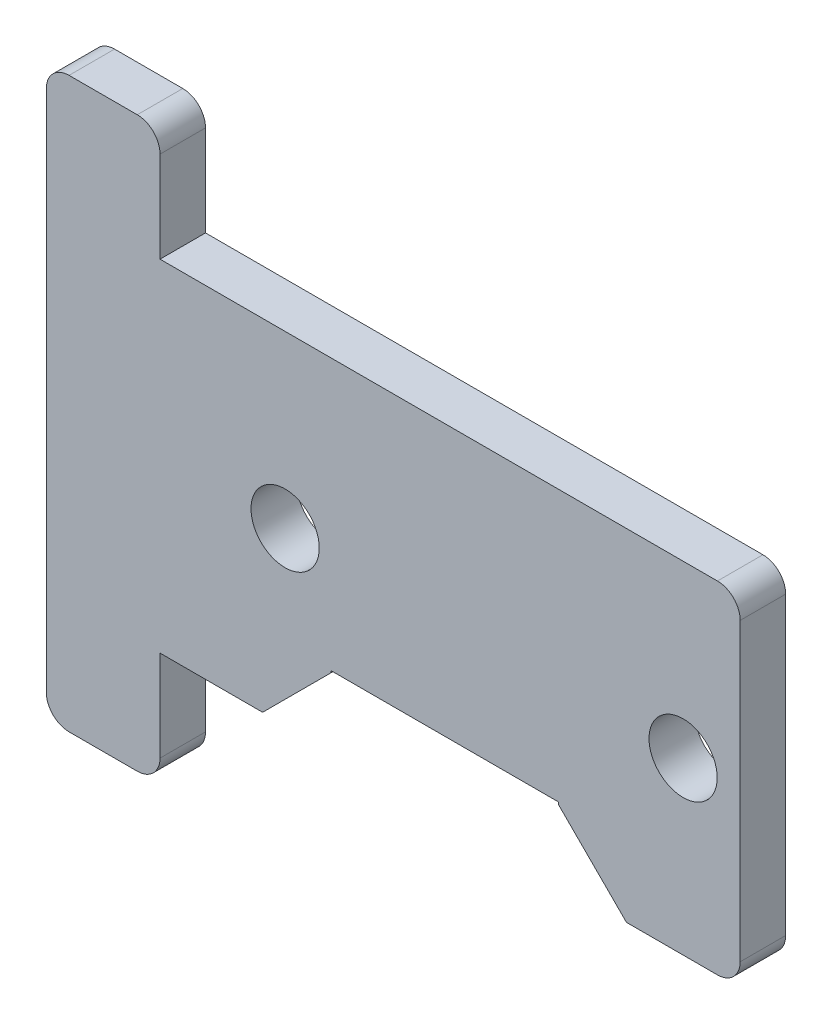
ISO-10303-21;
HEADER;
FILE_DESCRIPTION(('STEP AP214'),'2;1');
FILE_NAME('part.step','',(''),(''),'','','');
FILE_SCHEMA(('AUTOMOTIVE_DESIGN { 1 0 10303 214 1 1 1 1 }'));
ENDSEC;
DATA;
#1=APPLICATION_CONTEXT('core data for automotive mechanical design processes');
#2=APPLICATION_PROTOCOL_DEFINITION('international standard','automotive_design',2000,#1);
#3=PRODUCT_CONTEXT('',#1,'mechanical');
#4=PRODUCT('Part','Part','',(#3));
#5=PRODUCT_RELATED_PRODUCT_CATEGORY('part','',(#4));
#6=PRODUCT_DEFINITION_FORMATION('','',#4);
#7=PRODUCT_DEFINITION_CONTEXT('part definition',#1,'design');
#8=PRODUCT_DEFINITION('design','',#6,#7);
#9=PRODUCT_DEFINITION_SHAPE('','',#8);
#10=(LENGTH_UNIT() NAMED_UNIT(*) SI_UNIT(.MILLI.,.METRE.));
#11=(NAMED_UNIT(*) PLANE_ANGLE_UNIT() SI_UNIT($,.RADIAN.));
#12=(NAMED_UNIT(*) SI_UNIT($,.STERADIAN.) SOLID_ANGLE_UNIT());
#13=UNCERTAINTY_MEASURE_WITH_UNIT(LENGTH_MEASURE(1.E-05),#10,'distance_accuracy_value','');
#14=(GEOMETRIC_REPRESENTATION_CONTEXT(3) GLOBAL_UNCERTAINTY_ASSIGNED_CONTEXT((#13)) GLOBAL_UNIT_ASSIGNED_CONTEXT((#10,
#11,#12)) REPRESENTATION_CONTEXT('',''));
#15=CARTESIAN_POINT('',(0.,0.,0.));
#16=DIRECTION('',(0.,0.,1.));
#17=DIRECTION('',(1.,0.,0.));
#18=AXIS2_PLACEMENT_3D('',#15,#16,#17);
#19=CARTESIAN_POINT('',(-14.6463295776065,11.3032916310451,2.));
#20=DIRECTION('',(0.,0.,-1.));
#21=DIRECTION('',(-1.,0.,0.));
#22=AXIS2_PLACEMENT_3D('',#19,#20,#21);
#23=PLANE('',#22);
#24=CARTESIAN_POINT('',(-14.6463295776065,11.3032916310451,2.));
#25=DIRECTION('',(0.,0.,1.));
#26=DIRECTION('',(-1.,0.,0.));
#27=AXIS2_PLACEMENT_3D('',#24,#25,#26);
#28=CIRCLE('',#27,1.);
#29=CARTESIAN_POINT('',(-14.6463295776064,12.3032916310451,2.));
#30=VERTEX_POINT('',#29);
#31=CARTESIAN_POINT('',(-15.6463295776065,11.3032916310451,2.));
#32=VERTEX_POINT('',#31);
#33=EDGE_CURVE('E240',#30,#32,#28,.T.);
#34=ORIENTED_EDGE('',*,*,#33,.T.);
#35=DIRECTION('',(0.,-1.,0.));
#36=VECTOR('',#35,1.);
#37=CARTESIAN_POINT('',(-15.6463295776065,-11.6967083689549,2.));
#38=LINE('',#37,#36);
#39=CARTESIAN_POINT('',(-15.6463295776065,-11.6967083689549,2.));
#40=VERTEX_POINT('',#39);
#41=EDGE_CURVE('E128',#32,#40,#38,.T.);
#42=ORIENTED_EDGE('',*,*,#41,.T.);
#43=CARTESIAN_POINT('',(-14.6463295776065,-11.6967083689549,2.));
#44=DIRECTION('',(0.,0.,1.));
#45=DIRECTION('',(-1.,0.,0.));
#46=AXIS2_PLACEMENT_3D('',#43,#44,#45);
#47=CIRCLE('',#46,1.);
#48=CARTESIAN_POINT('',(-14.6463295776064,-12.6967083689549,2.));
#49=VERTEX_POINT('',#48);
#50=EDGE_CURVE('E291',#40,#49,#47,.T.);
#51=ORIENTED_EDGE('',*,*,#50,.T.);
#52=DIRECTION('',(1.,0.,0.));
#53=VECTOR('',#52,1.);
#54=CARTESIAN_POINT('',(-11.6463295776065,-12.6967083689549,2.));
#55=LINE('',#54,#53);
#56=CARTESIAN_POINT('',(-11.6463295776065,-12.6967083689549,2.));
#57=VERTEX_POINT('',#56);
#58=EDGE_CURVE('E310',#49,#57,#55,.T.);
#59=ORIENTED_EDGE('',*,*,#58,.T.);
#60=CARTESIAN_POINT('',(-11.6463295776065,-11.6967083689549,2.));
#61=DIRECTION('',(0.,0.,1.));
#62=DIRECTION('',(-1.,0.,0.));
#63=AXIS2_PLACEMENT_3D('',#60,#61,#62);
#64=CIRCLE('',#63,0.999999999999999);
#65=CARTESIAN_POINT('',(-10.6463295776065,-11.6967083689549,2.));
#66=VERTEX_POINT('',#65);
#67=EDGE_CURVE('E307',#57,#66,#64,.T.);
#68=ORIENTED_EDGE('',*,*,#67,.T.);
#69=DIRECTION('',(0.,1.,0.));
#70=VECTOR('',#69,1.);
#71=CARTESIAN_POINT('',(-10.6463295776065,-7.69670836895487,2.));
#72=LINE('',#71,#70);
#73=CARTESIAN_POINT('',(-10.6463295776065,-7.69670836895487,2.));
#74=VERTEX_POINT('',#73);
#75=EDGE_CURVE('E309',#66,#74,#72,.T.);
#76=ORIENTED_EDGE('',*,*,#75,.T.);
#77=DIRECTION('',(1.,0.,0.));
#78=VECTOR('',#77,1.);
#79=CARTESIAN_POINT('',(-6.13632957760645,-7.69670836895487,2.));
#80=LINE('',#79,#78);
#81=CARTESIAN_POINT('',(-6.13632957760645,-7.69670836895487,2.));
#82=VERTEX_POINT('',#81);
#83=EDGE_CURVE('E312',#74,#82,#80,.T.);
#84=ORIENTED_EDGE('',*,*,#83,.T.);
#85=DIRECTION('',(0.707106781186548,0.707106781186548,0.));
#86=VECTOR('',#85,1.);
#87=CARTESIAN_POINT('',(-3.13632957760645,-4.69670836895487,2.));
#88=LINE('',#87,#86);
#89=CARTESIAN_POINT('',(-3.13632957760645,-4.69670836895487,2.));
#90=VERTEX_POINT('',#89);
#91=EDGE_CURVE('E318',#82,#90,#88,.T.);
#92=ORIENTED_EDGE('',*,*,#91,.T.);
#93=DIRECTION('',(0.,1.,0.));
#94=VECTOR('',#93,1.);
#95=CARTESIAN_POINT('',(-3.13632957760645,-4.60540346731287,2.));
#96=LINE('',#95,#94);
#97=CARTESIAN_POINT('',(-3.13632957760645,-4.60540346731287,2.));
#98=VERTEX_POINT('',#97);
#99=EDGE_CURVE('E320',#90,#98,#96,.T.);
#100=ORIENTED_EDGE('',*,*,#99,.T.);
#101=DIRECTION('',(1.,0.,0.));
#102=VECTOR('',#101,1.);
#103=CARTESIAN_POINT('',(6.86367042239355,-4.60540346731287,2.));
#104=LINE('',#103,#102);
#105=CARTESIAN_POINT('',(6.86367042239355,-4.60540346731287,2.));
#106=VERTEX_POINT('',#105);
#107=EDGE_CURVE('E322',#98,#106,#104,.T.);
#108=ORIENTED_EDGE('',*,*,#107,.T.);
#109=DIRECTION('',(0.,-1.,0.));
#110=VECTOR('',#109,1.);
#111=CARTESIAN_POINT('',(6.86367042239355,-4.60540346731287,2.));
#112=LINE('',#111,#110);
#113=CARTESIAN_POINT('',(6.86367042239355,-4.69670836895487,2.));
#114=VERTEX_POINT('',#113);
#115=EDGE_CURVE('E324',#106,#114,#112,.T.);
#116=ORIENTED_EDGE('',*,*,#115,.T.);
#117=DIRECTION('',(0.707106781186548,-0.707106781186548,0.));
#118=VECTOR('',#117,1.);
#119=CARTESIAN_POINT('',(6.86367042239355,-4.69670836895487,2.));
#120=LINE('',#119,#118);
#121=CARTESIAN_POINT('',(9.86367042239355,-7.69670836895487,2.));
#122=VERTEX_POINT('',#121);
#123=EDGE_CURVE('E326',#114,#122,#120,.T.);
#124=ORIENTED_EDGE('',*,*,#123,.T.);
#125=DIRECTION('',(1.,0.,0.));
#126=VECTOR('',#125,1.);
#127=CARTESIAN_POINT('',(13.8636704223935,-7.69670836895487,2.));
#128=LINE('',#127,#126);
#129=CARTESIAN_POINT('',(13.8636704223935,-7.69670836895487,2.));
#130=VERTEX_POINT('',#129);
#131=EDGE_CURVE('E328',#122,#130,#128,.T.);
#132=ORIENTED_EDGE('',*,*,#131,.T.);
#133=CARTESIAN_POINT('',(13.8636704223935,-6.69670836895487,2.));
#134=DIRECTION('',(0.,0.,1.));
#135=DIRECTION('',(1.,0.,0.));
#136=AXIS2_PLACEMENT_3D('',#133,#134,#135);
#137=CIRCLE('',#136,1.);
#138=CARTESIAN_POINT('',(14.8636704223936,-6.69670836895487,2.));
#139=VERTEX_POINT('',#138);
#140=EDGE_CURVE('E330',#130,#139,#137,.T.);
#141=ORIENTED_EDGE('',*,*,#140,.T.);
#142=DIRECTION('',(0.,1.,0.));
#143=VECTOR('',#142,1.);
#144=CARTESIAN_POINT('',(14.8636704223936,-6.69670836895487,2.));
#145=LINE('',#144,#143);
#146=CARTESIAN_POINT('',(14.8636704223936,6.30329163104513,2.));
#147=VERTEX_POINT('',#146);
#148=EDGE_CURVE('E332',#139,#147,#145,.T.);
#149=ORIENTED_EDGE('',*,*,#148,.T.);
#150=CARTESIAN_POINT('',(13.8636704223935,6.30329163104513,2.));
#151=DIRECTION('',(0.,0.,1.));
#152=DIRECTION('',(1.,0.,0.));
#153=AXIS2_PLACEMENT_3D('',#150,#151,#152);
#154=CIRCLE('',#153,1.);
#155=CARTESIAN_POINT('',(13.8636704223935,7.30329163104513,2.));
#156=VERTEX_POINT('',#155);
#157=EDGE_CURVE('E334',#147,#156,#154,.T.);
#158=ORIENTED_EDGE('',*,*,#157,.T.);
#159=DIRECTION('',(-1.,0.,0.));
#160=VECTOR('',#159,1.);
#161=CARTESIAN_POINT('',(13.8636704223935,7.30329163104513,2.));
#162=LINE('',#161,#160);
#163=CARTESIAN_POINT('',(-10.6463295776065,7.30329163104513,2.));
#164=VERTEX_POINT('',#163);
#165=EDGE_CURVE('E183',#156,#164,#162,.T.);
#166=ORIENTED_EDGE('',*,*,#165,.T.);
#167=DIRECTION('',(0.,1.,0.));
#168=VECTOR('',#167,1.);
#169=CARTESIAN_POINT('',(-10.6463295776064,11.3032916310451,2.));
#170=LINE('',#169,#168);
#171=CARTESIAN_POINT('',(-10.6463295776064,11.3032916310451,2.));
#172=VERTEX_POINT('',#171);
#173=EDGE_CURVE('E177',#164,#172,#170,.T.);
#174=ORIENTED_EDGE('',*,*,#173,.T.);
#175=CARTESIAN_POINT('',(-11.6463295776065,11.3032916310451,2.));
#176=DIRECTION('',(0.,0.,1.));
#177=DIRECTION('',(-1.,0.,0.));
#178=AXIS2_PLACEMENT_3D('',#175,#176,#177);
#179=CIRCLE('',#178,1.);
#180=CARTESIAN_POINT('',(-11.6463295776065,12.3032916310451,2.));
#181=VERTEX_POINT('',#180);
#182=EDGE_CURVE('E181',#172,#181,#179,.T.);
#183=ORIENTED_EDGE('',*,*,#182,.T.);
#184=DIRECTION('',(-1.,0.,0.));
#185=VECTOR('',#184,1.);
#186=CARTESIAN_POINT('',(-14.6463295776064,12.3032916310451,2.));
#187=LINE('',#186,#185);
#188=EDGE_CURVE('E49',#181,#30,#187,.T.);
#189=ORIENTED_EDGE('',*,*,#188,.T.);
#190=EDGE_LOOP('',(#34,#42,#51,#59,#68,#76,#84,#92,#100,#108,#116,#124,#132,#141,#149,#158,#166,
#174,#183,#189));
#191=FACE_BOUND('',#190,.T.);
#192=CARTESIAN_POINT('',(12.3536704223936,-0.196708368954862,2.));
#193=DIRECTION('',(0.,0.,1.));
#194=DIRECTION('',(1.,0.,0.));
#195=AXIS2_PLACEMENT_3D('',#192,#193,#194);
#196=CIRCLE('',#195,1.5);
#197=CARTESIAN_POINT('',(13.8536704223935,-0.196708368954862,2.));
#198=VERTEX_POINT('',#197);
#199=EDGE_CURVE('E205',#198,#198,#196,.T.);
#200=ORIENTED_EDGE('',*,*,#199,.F.);
#201=EDGE_LOOP('',(#200));
#202=FACE_BOUND('',#201,.T.);
#203=CARTESIAN_POINT('',(-5.14632957760645,-0.196708368954869,2.));
#204=DIRECTION('',(0.,0.,1.));
#205=DIRECTION('',(1.,0.,0.));
#206=AXIS2_PLACEMENT_3D('',#203,#204,#205);
#207=CIRCLE('',#206,1.5);
#208=CARTESIAN_POINT('',(-3.64632957760645,-0.196708368954869,2.));
#209=VERTEX_POINT('',#208);
#210=EDGE_CURVE('E375',#209,#209,#207,.T.);
#211=ORIENTED_EDGE('',*,*,#210,.F.);
#212=EDGE_LOOP('',(#211));
#213=FACE_BOUND('',#212,.T.);
#214=ADVANCED_FACE('F32',(#191,#202,#213),#23,.F.);
#215=CARTESIAN_POINT('',(-14.6463295776065,11.3032916310451,0.));
#216=DIRECTION('',(0.,0.,-1.));
#217=DIRECTION('',(-1.,0.,0.));
#218=AXIS2_PLACEMENT_3D('',#215,#216,#217);
#219=PLANE('',#218);
#220=CARTESIAN_POINT('',(12.3536704223936,-0.196708368954862,0.));
#221=DIRECTION('',(0.,0.,1.));
#222=DIRECTION('',(1.,0.,0.));
#223=AXIS2_PLACEMENT_3D('',#220,#221,#222);
#224=CIRCLE('',#223,1.5);
#225=CARTESIAN_POINT('',(13.8536704223935,-0.196708368954862,0.));
#226=VERTEX_POINT('',#225);
#227=EDGE_CURVE('E380',#226,#226,#224,.T.);
#228=ORIENTED_EDGE('',*,*,#227,.T.);
#229=EDGE_LOOP('',(#228));
#230=FACE_BOUND('',#229,.T.);
#231=CARTESIAN_POINT('',(-14.6463295776065,11.3032916310451,0.));
#232=DIRECTION('',(0.,0.,1.));
#233=DIRECTION('',(-1.,0.,0.));
#234=AXIS2_PLACEMENT_3D('',#231,#232,#233);
#235=CIRCLE('',#234,1.);
#236=CARTESIAN_POINT('',(-14.6463295776064,12.3032916310451,0.));
#237=VERTEX_POINT('',#236);
#238=CARTESIAN_POINT('',(-15.6463295776065,11.3032916310451,0.));
#239=VERTEX_POINT('',#238);
#240=EDGE_CURVE('E201',#237,#239,#235,.T.);
#241=ORIENTED_EDGE('',*,*,#240,.F.);
#242=DIRECTION('',(-1.,0.,0.));
#243=VECTOR('',#242,1.);
#244=CARTESIAN_POINT('',(-14.6463295776064,12.3032916310451,0.));
#245=LINE('',#244,#243);
#246=CARTESIAN_POINT('',(-11.6463295776065,12.3032916310451,0.));
#247=VERTEX_POINT('',#246);
#248=EDGE_CURVE('E120',#247,#237,#245,.T.);
#249=ORIENTED_EDGE('',*,*,#248,.F.);
#250=CARTESIAN_POINT('',(-11.6463295776065,11.3032916310451,0.));
#251=DIRECTION('',(0.,0.,1.));
#252=DIRECTION('',(-1.,0.,0.));
#253=AXIS2_PLACEMENT_3D('',#250,#251,#252);
#254=CIRCLE('',#253,1.);
#255=CARTESIAN_POINT('',(-10.6463295776064,11.3032916310451,0.));
#256=VERTEX_POINT('',#255);
#257=EDGE_CURVE('E114',#256,#247,#254,.T.);
#258=ORIENTED_EDGE('',*,*,#257,.F.);
#259=DIRECTION('',(0.,1.,0.));
#260=VECTOR('',#259,1.);
#261=CARTESIAN_POINT('',(-10.6463295776064,11.3032916310451,0.));
#262=LINE('',#261,#260);
#263=CARTESIAN_POINT('',(-10.6463295776065,7.30329163104513,0.));
#264=VERTEX_POINT('',#263);
#265=EDGE_CURVE('E191',#264,#256,#262,.T.);
#266=ORIENTED_EDGE('',*,*,#265,.F.);
#267=DIRECTION('',(-1.,0.,0.));
#268=VECTOR('',#267,1.);
#269=CARTESIAN_POINT('',(13.8636704223935,7.30329163104513,0.));
#270=LINE('',#269,#268);
#271=CARTESIAN_POINT('',(13.8636704223935,7.30329163104513,0.));
#272=VERTEX_POINT('',#271);
#273=EDGE_CURVE('E235',#272,#264,#270,.T.);
#274=ORIENTED_EDGE('',*,*,#273,.F.);
#275=CARTESIAN_POINT('',(13.8636704223935,6.30329163104513,0.));
#276=DIRECTION('',(0.,0.,1.));
#277=DIRECTION('',(1.,0.,0.));
#278=AXIS2_PLACEMENT_3D('',#275,#276,#277);
#279=CIRCLE('',#278,1.);
#280=CARTESIAN_POINT('',(14.8636704223936,6.30329163104513,0.));
#281=VERTEX_POINT('',#280);
#282=EDGE_CURVE('E233',#281,#272,#279,.T.);
#283=ORIENTED_EDGE('',*,*,#282,.F.);
#284=DIRECTION('',(0.,1.,0.));
#285=VECTOR('',#284,1.);
#286=CARTESIAN_POINT('',(14.8636704223936,-6.69670836895487,0.));
#287=LINE('',#286,#285);
#288=CARTESIAN_POINT('',(14.8636704223936,-6.69670836895487,0.));
#289=VERTEX_POINT('',#288);
#290=EDGE_CURVE('E231',#289,#281,#287,.T.);
#291=ORIENTED_EDGE('',*,*,#290,.F.);
#292=CARTESIAN_POINT('',(13.8636704223935,-6.69670836895487,0.));
#293=DIRECTION('',(0.,0.,1.));
#294=DIRECTION('',(1.,0.,0.));
#295=AXIS2_PLACEMENT_3D('',#292,#293,#294);
#296=CIRCLE('',#295,1.);
#297=CARTESIAN_POINT('',(13.8636704223935,-7.69670836895487,0.));
#298=VERTEX_POINT('',#297);
#299=EDGE_CURVE('E229',#298,#289,#296,.T.);
#300=ORIENTED_EDGE('',*,*,#299,.F.);
#301=DIRECTION('',(1.,0.,0.));
#302=VECTOR('',#301,1.);
#303=CARTESIAN_POINT('',(13.8636704223935,-7.69670836895487,0.));
#304=LINE('',#303,#302);
#305=CARTESIAN_POINT('',(9.86367042239355,-7.69670836895487,0.));
#306=VERTEX_POINT('',#305);
#307=EDGE_CURVE('E227',#306,#298,#304,.T.);
#308=ORIENTED_EDGE('',*,*,#307,.F.);
#309=DIRECTION('',(0.707106781186548,-0.707106781186548,0.));
#310=VECTOR('',#309,1.);
#311=CARTESIAN_POINT('',(6.86367042239355,-4.69670836895487,0.));
#312=LINE('',#311,#310);
#313=CARTESIAN_POINT('',(6.86367042239355,-4.69670836895487,0.));
#314=VERTEX_POINT('',#313);
#315=EDGE_CURVE('E225',#314,#306,#312,.T.);
#316=ORIENTED_EDGE('',*,*,#315,.F.);
#317=DIRECTION('',(0.,-1.,0.));
#318=VECTOR('',#317,1.);
#319=CARTESIAN_POINT('',(6.86367042239355,-4.60540346731287,0.));
#320=LINE('',#319,#318);
#321=CARTESIAN_POINT('',(6.86367042239355,-4.60540346731287,0.));
#322=VERTEX_POINT('',#321);
#323=EDGE_CURVE('E223',#322,#314,#320,.T.);
#324=ORIENTED_EDGE('',*,*,#323,.F.);
#325=DIRECTION('',(1.,0.,0.));
#326=VECTOR('',#325,1.);
#327=CARTESIAN_POINT('',(6.86367042239355,-4.60540346731287,0.));
#328=LINE('',#327,#326);
#329=CARTESIAN_POINT('',(-3.13632957760645,-4.60540346731287,0.));
#330=VERTEX_POINT('',#329);
#331=EDGE_CURVE('E221',#330,#322,#328,.T.);
#332=ORIENTED_EDGE('',*,*,#331,.F.);
#333=DIRECTION('',(0.,1.,0.));
#334=VECTOR('',#333,1.);
#335=CARTESIAN_POINT('',(-3.13632957760645,-4.60540346731287,0.));
#336=LINE('',#335,#334);
#337=CARTESIAN_POINT('',(-3.13632957760645,-4.69670836895487,0.));
#338=VERTEX_POINT('',#337);
#339=EDGE_CURVE('E219',#338,#330,#336,.T.);
#340=ORIENTED_EDGE('',*,*,#339,.F.);
#341=DIRECTION('',(0.707106781186548,0.707106781186548,0.));
#342=VECTOR('',#341,1.);
#343=CARTESIAN_POINT('',(-3.13632957760645,-4.69670836895487,0.));
#344=LINE('',#343,#342);
#345=CARTESIAN_POINT('',(-6.13632957760645,-7.69670836895487,0.));
#346=VERTEX_POINT('',#345);
#347=EDGE_CURVE('E217',#346,#338,#344,.T.);
#348=ORIENTED_EDGE('',*,*,#347,.F.);
#349=DIRECTION('',(1.,0.,0.));
#350=VECTOR('',#349,1.);
#351=CARTESIAN_POINT('',(-6.13632957760645,-7.69670836895487,0.));
#352=LINE('',#351,#350);
#353=CARTESIAN_POINT('',(-10.6463295776065,-7.69670836895487,0.));
#354=VERTEX_POINT('',#353);
#355=EDGE_CURVE('E215',#354,#346,#352,.T.);
#356=ORIENTED_EDGE('',*,*,#355,.F.);
#357=DIRECTION('',(0.,1.,0.));
#358=VECTOR('',#357,1.);
#359=CARTESIAN_POINT('',(-10.6463295776065,-7.69670836895487,0.));
#360=LINE('',#359,#358);
#361=CARTESIAN_POINT('',(-10.6463295776065,-11.6967083689549,0.));
#362=VERTEX_POINT('',#361);
#363=EDGE_CURVE('E213',#362,#354,#360,.T.);
#364=ORIENTED_EDGE('',*,*,#363,.F.);
#365=CARTESIAN_POINT('',(-11.6463295776065,-11.6967083689549,0.));
#366=DIRECTION('',(0.,0.,1.));
#367=DIRECTION('',(-1.,0.,0.));
#368=AXIS2_PLACEMENT_3D('',#365,#366,#367);
#369=CIRCLE('',#368,0.999999999999999);
#370=CARTESIAN_POINT('',(-11.6463295776065,-12.6967083689549,0.));
#371=VERTEX_POINT('',#370);
#372=EDGE_CURVE('E211',#371,#362,#369,.T.);
#373=ORIENTED_EDGE('',*,*,#372,.F.);
#374=DIRECTION('',(1.,0.,0.));
#375=VECTOR('',#374,1.);
#376=CARTESIAN_POINT('',(-11.6463295776065,-12.6967083689549,0.));
#377=LINE('',#376,#375);
#378=CARTESIAN_POINT('',(-14.6463295776064,-12.6967083689549,0.));
#379=VERTEX_POINT('',#378);
#380=EDGE_CURVE('E209',#379,#371,#377,.T.);
#381=ORIENTED_EDGE('',*,*,#380,.F.);
#382=CARTESIAN_POINT('',(-14.6463295776065,-11.6967083689549,0.));
#383=DIRECTION('',(0.,0.,1.));
#384=DIRECTION('',(-1.,0.,0.));
#385=AXIS2_PLACEMENT_3D('',#382,#383,#384);
#386=CIRCLE('',#385,1.);
#387=CARTESIAN_POINT('',(-15.6463295776065,-11.6967083689549,0.));
#388=VERTEX_POINT('',#387);
#389=EDGE_CURVE('E207',#388,#379,#386,.T.);
#390=ORIENTED_EDGE('',*,*,#389,.F.);
#391=DIRECTION('',(0.,-1.,0.));
#392=VECTOR('',#391,1.);
#393=CARTESIAN_POINT('',(-15.6463295776065,-11.6967083689549,0.));
#394=LINE('',#393,#392);
#395=EDGE_CURVE('E204',#239,#388,#394,.T.);
#396=ORIENTED_EDGE('',*,*,#395,.F.);
#397=EDGE_LOOP('',(#241,#249,#258,#266,#274,#283,#291,#300,#308,#316,#324,#332,#340,#348,#356,
#364,#373,#381,#390,#396));
#398=FACE_BOUND('',#397,.T.);
#399=CARTESIAN_POINT('',(-5.14632957760645,-0.196708368954869,0.));
#400=DIRECTION('',(0.,0.,1.));
#401=DIRECTION('',(1.,0.,0.));
#402=AXIS2_PLACEMENT_3D('',#399,#400,#401);
#403=CIRCLE('',#402,1.5);
#404=CARTESIAN_POINT('',(-3.64632957760645,-0.196708368954869,0.));
#405=VERTEX_POINT('',#404);
#406=EDGE_CURVE('E378',#405,#405,#403,.T.);
#407=ORIENTED_EDGE('',*,*,#406,.T.);
#408=EDGE_LOOP('',(#407));
#409=FACE_BOUND('',#408,.T.);
#410=ADVANCED_FACE('F295',(#230,#398,#409),#219,.T.);
#411=CARTESIAN_POINT('',(-14.6463295776065,11.3032916310451,2.));
#412=DIRECTION('',(0.,0.,-1.));
#413=DIRECTION('',(-1.,0.,0.));
#414=AXIS2_PLACEMENT_3D('',#411,#412,#413);
#415=CYLINDRICAL_SURFACE('',#414,1.);
#416=ORIENTED_EDGE('',*,*,#240,.T.);
#417=DIRECTION('',(0.,0.,-1.));
#418=VECTOR('',#417,1.);
#419=CARTESIAN_POINT('',(-15.6463295776065,11.3032916310451,2.));
#420=LINE('',#419,#418);
#421=EDGE_CURVE('E11',#32,#239,#420,.T.);
#422=ORIENTED_EDGE('',*,*,#421,.F.);
#423=ORIENTED_EDGE('',*,*,#33,.F.);
#424=DIRECTION('',(0.,0.,-1.));
#425=VECTOR('',#424,1.);
#426=CARTESIAN_POINT('',(-14.6463295776064,12.3032916310451,2.));
#427=LINE('',#426,#425);
#428=EDGE_CURVE('E197',#30,#237,#427,.T.);
#429=ORIENTED_EDGE('',*,*,#428,.T.);
#430=EDGE_LOOP('',(#416,#422,#423,#429));
#431=FACE_BOUND('',#430,.T.);
#432=ADVANCED_FACE('F34',(#431),#415,.T.);
#433=CARTESIAN_POINT('',(-15.6463295776065,-11.6967083689549,2.));
#434=DIRECTION('',(1.,0.,0.));
#435=DIRECTION('',(0.,0.,-1.));
#436=AXIS2_PLACEMENT_3D('',#433,#434,#435);
#437=PLANE('',#436);
#438=ORIENTED_EDGE('',*,*,#395,.T.);
#439=DIRECTION('',(0.,0.,-1.));
#440=VECTOR('',#439,1.);
#441=CARTESIAN_POINT('',(-15.6463295776065,-11.6967083689549,2.));
#442=LINE('',#441,#440);
#443=EDGE_CURVE('E41',#40,#388,#442,.T.);
#444=ORIENTED_EDGE('',*,*,#443,.F.);
#445=ORIENTED_EDGE('',*,*,#41,.F.);
#446=ORIENTED_EDGE('',*,*,#421,.T.);
#447=EDGE_LOOP('',(#438,#444,#445,#446));
#448=FACE_BOUND('',#447,.T.);
#449=ADVANCED_FACE('F555',(#448),#437,.F.);
#450=CARTESIAN_POINT('',(-14.6463295776065,-11.6967083689549,2.));
#451=DIRECTION('',(0.,0.,-1.));
#452=DIRECTION('',(-1.,0.,0.));
#453=AXIS2_PLACEMENT_3D('',#450,#451,#452);
#454=CYLINDRICAL_SURFACE('',#453,1.);
#455=ORIENTED_EDGE('',*,*,#389,.T.);
#456=DIRECTION('',(0.,0.,-1.));
#457=VECTOR('',#456,1.);
#458=CARTESIAN_POINT('',(-14.6463295776064,-12.6967083689549,2.));
#459=LINE('',#458,#457);
#460=EDGE_CURVE('E283',#49,#379,#459,.T.);
#461=ORIENTED_EDGE('',*,*,#460,.F.);
#462=ORIENTED_EDGE('',*,*,#50,.F.);
#463=ORIENTED_EDGE('',*,*,#443,.T.);
#464=EDGE_LOOP('',(#455,#461,#462,#463));
#465=FACE_BOUND('',#464,.T.);
#466=ADVANCED_FACE('F289',(#465),#454,.T.);
#467=CARTESIAN_POINT('',(-11.6463295776065,-12.6967083689549,2.));
#468=DIRECTION('',(0.,1.,0.));
#469=DIRECTION('',(-1.,0.,0.));
#470=AXIS2_PLACEMENT_3D('',#467,#468,#469);
#471=PLANE('',#470);
#472=ORIENTED_EDGE('',*,*,#380,.T.);
#473=DIRECTION('',(0.,0.,-1.));
#474=VECTOR('',#473,1.);
#475=CARTESIAN_POINT('',(-11.6463295776065,-12.6967083689549,2.));
#476=LINE('',#475,#474);
#477=EDGE_CURVE('E280',#57,#371,#476,.T.);
#478=ORIENTED_EDGE('',*,*,#477,.F.);
#479=ORIENTED_EDGE('',*,*,#58,.F.);
#480=ORIENTED_EDGE('',*,*,#460,.T.);
#481=EDGE_LOOP('',(#472,#478,#479,#480));
#482=FACE_BOUND('',#481,.T.);
#483=ADVANCED_FACE('F301',(#482),#471,.F.);
#484=CARTESIAN_POINT('',(-11.6463295776065,-11.6967083689549,2.));
#485=DIRECTION('',(0.,0.,-1.));
#486=DIRECTION('',(-1.,0.,0.));
#487=AXIS2_PLACEMENT_3D('',#484,#485,#486);
#488=CYLINDRICAL_SURFACE('',#487,0.999999999999999);
#489=ORIENTED_EDGE('',*,*,#372,.T.);
#490=DIRECTION('',(0.,0.,-1.));
#491=VECTOR('',#490,1.);
#492=CARTESIAN_POINT('',(-10.6463295776065,-11.6967083689549,2.));
#493=LINE('',#492,#491);
#494=EDGE_CURVE('E277',#66,#362,#493,.T.);
#495=ORIENTED_EDGE('',*,*,#494,.F.);
#496=ORIENTED_EDGE('',*,*,#67,.F.);
#497=ORIENTED_EDGE('',*,*,#477,.T.);
#498=EDGE_LOOP('',(#489,#495,#496,#497));
#499=FACE_BOUND('',#498,.T.);
#500=ADVANCED_FACE('F305',(#499),#488,.T.);
#501=CARTESIAN_POINT('',(-10.6463295776065,-7.69670836895487,2.));
#502=DIRECTION('',(-1.,0.,0.));
#503=DIRECTION('',(0.,-1.,0.));
#504=AXIS2_PLACEMENT_3D('',#501,#502,#503);
#505=PLANE('',#504);
#506=ORIENTED_EDGE('',*,*,#363,.T.);
#507=DIRECTION('',(0.,0.,-1.));
#508=VECTOR('',#507,1.);
#509=CARTESIAN_POINT('',(-10.6463295776065,-7.69670836895487,2.));
#510=LINE('',#509,#508);
#511=EDGE_CURVE('E274',#74,#354,#510,.T.);
#512=ORIENTED_EDGE('',*,*,#511,.F.);
#513=ORIENTED_EDGE('',*,*,#75,.F.);
#514=ORIENTED_EDGE('',*,*,#494,.T.);
#515=EDGE_LOOP('',(#506,#512,#513,#514));
#516=FACE_BOUND('',#515,.T.);
#517=ADVANCED_FACE('F520',(#516),#505,.F.);
#518=CARTESIAN_POINT('',(-6.13632957760645,-7.69670836895487,2.));
#519=DIRECTION('',(0.,1.,0.));
#520=DIRECTION('',(-1.,0.,0.));
#521=AXIS2_PLACEMENT_3D('',#518,#519,#520);
#522=PLANE('',#521);
#523=ORIENTED_EDGE('',*,*,#355,.T.);
#524=DIRECTION('',(0.,0.,-1.));
#525=VECTOR('',#524,1.);
#526=CARTESIAN_POINT('',(-6.13632957760645,-7.69670836895487,2.));
#527=LINE('',#526,#525);
#528=EDGE_CURVE('E271',#82,#346,#527,.T.);
#529=ORIENTED_EDGE('',*,*,#528,.F.);
#530=ORIENTED_EDGE('',*,*,#83,.F.);
#531=ORIENTED_EDGE('',*,*,#511,.T.);
#532=EDGE_LOOP('',(#523,#529,#530,#531));
#533=FACE_BOUND('',#532,.T.);
#534=ADVANCED_FACE('F510',(#533),#522,.F.);
#535=CARTESIAN_POINT('',(-3.13632957760645,-4.69670836895487,2.));
#536=DIRECTION('',(-0.707106781186547,0.707106781186547,0.));
#537=DIRECTION('',(-0.707106781186548,-0.707106781186548,0.));
#538=AXIS2_PLACEMENT_3D('',#535,#536,#537);
#539=PLANE('',#538);
#540=ORIENTED_EDGE('',*,*,#347,.T.);
#541=DIRECTION('',(0.,0.,-1.));
#542=VECTOR('',#541,1.);
#543=CARTESIAN_POINT('',(-3.13632957760645,-4.69670836895487,2.));
#544=LINE('',#543,#542);
#545=EDGE_CURVE('E268',#90,#338,#544,.T.);
#546=ORIENTED_EDGE('',*,*,#545,.F.);
#547=ORIENTED_EDGE('',*,*,#91,.F.);
#548=ORIENTED_EDGE('',*,*,#528,.T.);
#549=EDGE_LOOP('',(#540,#546,#547,#548));
#550=FACE_BOUND('',#549,.T.);
#551=ADVANCED_FACE('F500',(#550),#539,.F.);
#552=CARTESIAN_POINT('',(-3.13632957760645,-4.60540346731287,2.));
#553=DIRECTION('',(-1.,0.,0.));
#554=DIRECTION('',(0.,0.,1.));
#555=AXIS2_PLACEMENT_3D('',#552,#553,#554);
#556=PLANE('',#555);
#557=ORIENTED_EDGE('',*,*,#339,.T.);
#558=DIRECTION('',(0.,0.,-1.));
#559=VECTOR('',#558,1.);
#560=CARTESIAN_POINT('',(-3.13632957760645,-4.60540346731287,2.));
#561=LINE('',#560,#559);
#562=EDGE_CURVE('E265',#98,#330,#561,.T.);
#563=ORIENTED_EDGE('',*,*,#562,.F.);
#564=ORIENTED_EDGE('',*,*,#99,.F.);
#565=ORIENTED_EDGE('',*,*,#545,.T.);
#566=EDGE_LOOP('',(#557,#563,#564,#565));
#567=FACE_BOUND('',#566,.T.);
#568=ADVANCED_FACE('F490',(#567),#556,.F.);
#569=CARTESIAN_POINT('',(6.86367042239355,-4.60540346731287,2.));
#570=DIRECTION('',(0.,1.,0.));
#571=DIRECTION('',(-1.,0.,0.));
#572=AXIS2_PLACEMENT_3D('',#569,#570,#571);
#573=PLANE('',#572);
#574=ORIENTED_EDGE('',*,*,#331,.T.);
#575=DIRECTION('',(0.,0.,-1.));
#576=VECTOR('',#575,1.);
#577=CARTESIAN_POINT('',(6.86367042239355,-4.60540346731287,2.));
#578=LINE('',#577,#576);
#579=EDGE_CURVE('E262',#106,#322,#578,.T.);
#580=ORIENTED_EDGE('',*,*,#579,.F.);
#581=ORIENTED_EDGE('',*,*,#107,.F.);
#582=ORIENTED_EDGE('',*,*,#562,.T.);
#583=EDGE_LOOP('',(#574,#580,#581,#582));
#584=FACE_BOUND('',#583,.T.);
#585=ADVANCED_FACE('F480',(#584),#573,.F.);
#586=CARTESIAN_POINT('',(6.86367042239355,-4.60540346731287,2.));
#587=DIRECTION('',(1.,0.,0.));
#588=DIRECTION('',(0.,0.,-1.));
#589=AXIS2_PLACEMENT_3D('',#586,#587,#588);
#590=PLANE('',#589);
#591=ORIENTED_EDGE('',*,*,#323,.T.);
#592=DIRECTION('',(0.,0.,-1.));
#593=VECTOR('',#592,1.);
#594=CARTESIAN_POINT('',(6.86367042239355,-4.69670836895487,2.));
#595=LINE('',#594,#593);
#596=EDGE_CURVE('E259',#114,#314,#595,.T.);
#597=ORIENTED_EDGE('',*,*,#596,.F.);
#598=ORIENTED_EDGE('',*,*,#115,.F.);
#599=ORIENTED_EDGE('',*,*,#579,.T.);
#600=EDGE_LOOP('',(#591,#597,#598,#599));
#601=FACE_BOUND('',#600,.T.);
#602=ADVANCED_FACE('F470',(#601),#590,.F.);
#603=CARTESIAN_POINT('',(6.86367042239355,-4.69670836895487,2.));
#604=DIRECTION('',(0.707106781186547,0.707106781186547,0.));
#605=DIRECTION('',(-0.707106781186548,0.707106781186548,0.));
#606=AXIS2_PLACEMENT_3D('',#603,#604,#605);
#607=PLANE('',#606);
#608=ORIENTED_EDGE('',*,*,#315,.T.);
#609=DIRECTION('',(0.,0.,-1.));
#610=VECTOR('',#609,1.);
#611=CARTESIAN_POINT('',(9.86367042239355,-7.69670836895487,2.));
#612=LINE('',#611,#610);
#613=EDGE_CURVE('E256',#122,#306,#612,.T.);
#614=ORIENTED_EDGE('',*,*,#613,.F.);
#615=ORIENTED_EDGE('',*,*,#123,.F.);
#616=ORIENTED_EDGE('',*,*,#596,.T.);
#617=EDGE_LOOP('',(#608,#614,#615,#616));
#618=FACE_BOUND('',#617,.T.);
#619=ADVANCED_FACE('F460',(#618),#607,.F.);
#620=CARTESIAN_POINT('',(13.8636704223935,-7.69670836895487,2.));
#621=DIRECTION('',(0.,1.,0.));
#622=DIRECTION('',(-1.,0.,0.));
#623=AXIS2_PLACEMENT_3D('',#620,#621,#622);
#624=PLANE('',#623);
#625=ORIENTED_EDGE('',*,*,#307,.T.);
#626=DIRECTION('',(0.,0.,-1.));
#627=VECTOR('',#626,1.);
#628=CARTESIAN_POINT('',(13.8636704223935,-7.69670836895487,2.));
#629=LINE('',#628,#627);
#630=EDGE_CURVE('E253',#130,#298,#629,.T.);
#631=ORIENTED_EDGE('',*,*,#630,.F.);
#632=ORIENTED_EDGE('',*,*,#131,.F.);
#633=ORIENTED_EDGE('',*,*,#613,.T.);
#634=EDGE_LOOP('',(#625,#631,#632,#633));
#635=FACE_BOUND('',#634,.T.);
#636=ADVANCED_FACE('F450',(#635),#624,.F.);
#637=CARTESIAN_POINT('',(13.8636704223935,-6.69670836895487,2.));
#638=DIRECTION('',(0.,0.,-1.));
#639=DIRECTION('',(-1.,0.,0.));
#640=AXIS2_PLACEMENT_3D('',#637,#638,#639);
#641=CYLINDRICAL_SURFACE('',#640,1.);
#642=ORIENTED_EDGE('',*,*,#299,.T.);
#643=DIRECTION('',(0.,0.,-1.));
#644=VECTOR('',#643,1.);
#645=CARTESIAN_POINT('',(14.8636704223936,-6.69670836895487,2.));
#646=LINE('',#645,#644);
#647=EDGE_CURVE('E250',#139,#289,#646,.T.);
#648=ORIENTED_EDGE('',*,*,#647,.F.);
#649=ORIENTED_EDGE('',*,*,#140,.F.);
#650=ORIENTED_EDGE('',*,*,#630,.T.);
#651=EDGE_LOOP('',(#642,#648,#649,#650));
#652=FACE_BOUND('',#651,.T.);
#653=ADVANCED_FACE('F440',(#652),#641,.T.);
#654=CARTESIAN_POINT('',(14.8636704223936,-6.69670836895487,2.));
#655=DIRECTION('',(-1.,0.,0.));
#656=DIRECTION('',(0.,-1.,0.));
#657=AXIS2_PLACEMENT_3D('',#654,#655,#656);
#658=PLANE('',#657);
#659=ORIENTED_EDGE('',*,*,#290,.T.);
#660=DIRECTION('',(0.,0.,-1.));
#661=VECTOR('',#660,1.);
#662=CARTESIAN_POINT('',(14.8636704223936,6.30329163104513,2.));
#663=LINE('',#662,#661);
#664=EDGE_CURVE('E247',#147,#281,#663,.T.);
#665=ORIENTED_EDGE('',*,*,#664,.F.);
#666=ORIENTED_EDGE('',*,*,#148,.F.);
#667=ORIENTED_EDGE('',*,*,#647,.T.);
#668=EDGE_LOOP('',(#659,#665,#666,#667));
#669=FACE_BOUND('',#668,.T.);
#670=ADVANCED_FACE('F431',(#669),#658,.F.);
#671=CARTESIAN_POINT('',(13.8636704223935,6.30329163104513,2.));
#672=DIRECTION('',(0.,0.,-1.));
#673=DIRECTION('',(-1.,0.,0.));
#674=AXIS2_PLACEMENT_3D('',#671,#672,#673);
#675=CYLINDRICAL_SURFACE('',#674,1.);
#676=ORIENTED_EDGE('',*,*,#282,.T.);
#677=DIRECTION('',(0.,0.,-1.));
#678=VECTOR('',#677,1.);
#679=CARTESIAN_POINT('',(13.8636704223935,7.30329163104513,2.));
#680=LINE('',#679,#678);
#681=EDGE_CURVE('E244',#156,#272,#680,.T.);
#682=ORIENTED_EDGE('',*,*,#681,.F.);
#683=ORIENTED_EDGE('',*,*,#157,.F.);
#684=ORIENTED_EDGE('',*,*,#664,.T.);
#685=EDGE_LOOP('',(#676,#682,#683,#684));
#686=FACE_BOUND('',#685,.T.);
#687=ADVANCED_FACE('F340',(#686),#675,.T.);
#688=CARTESIAN_POINT('',(13.8636704223935,7.30329163104513,2.));
#689=DIRECTION('',(0.,-1.,0.));
#690=DIRECTION('',(1.,0.,0.));
#691=AXIS2_PLACEMENT_3D('',#688,#689,#690);
#692=PLANE('',#691);
#693=ORIENTED_EDGE('',*,*,#273,.T.);
#694=DIRECTION('',(0.,0.,-1.));
#695=VECTOR('',#694,1.);
#696=CARTESIAN_POINT('',(-10.6463295776065,7.30329163104513,2.));
#697=LINE('',#696,#695);
#698=EDGE_CURVE('E192',#164,#264,#697,.T.);
#699=ORIENTED_EDGE('',*,*,#698,.F.);
#700=ORIENTED_EDGE('',*,*,#165,.F.);
#701=ORIENTED_EDGE('',*,*,#681,.T.);
#702=EDGE_LOOP('',(#693,#699,#700,#701));
#703=FACE_BOUND('',#702,.T.);
#704=ADVANCED_FACE('F344',(#703),#692,.F.);
#705=CARTESIAN_POINT('',(-10.6463295776064,11.3032916310451,2.));
#706=DIRECTION('',(-1.,0.,0.));
#707=DIRECTION('',(0.,-1.,0.));
#708=AXIS2_PLACEMENT_3D('',#705,#706,#707);
#709=PLANE('',#708);
#710=ORIENTED_EDGE('',*,*,#265,.T.);
#711=DIRECTION('',(0.,0.,-1.));
#712=VECTOR('',#711,1.);
#713=CARTESIAN_POINT('',(-10.6463295776064,11.3032916310451,2.));
#714=LINE('',#713,#712);
#715=EDGE_CURVE('E188',#172,#256,#714,.T.);
#716=ORIENTED_EDGE('',*,*,#715,.F.);
#717=ORIENTED_EDGE('',*,*,#173,.F.);
#718=ORIENTED_EDGE('',*,*,#698,.T.);
#719=EDGE_LOOP('',(#710,#716,#717,#718));
#720=FACE_BOUND('',#719,.T.);
#721=ADVANCED_FACE('F189',(#720),#709,.F.);
#722=CARTESIAN_POINT('',(-11.6463295776065,11.3032916310451,2.));
#723=DIRECTION('',(0.,0.,-1.));
#724=DIRECTION('',(-1.,0.,0.));
#725=AXIS2_PLACEMENT_3D('',#722,#723,#724);
#726=CYLINDRICAL_SURFACE('',#725,1.);
#727=ORIENTED_EDGE('',*,*,#257,.T.);
#728=DIRECTION('',(0.,0.,-1.));
#729=VECTOR('',#728,1.);
#730=CARTESIAN_POINT('',(-11.6463295776065,12.3032916310451,2.));
#731=LINE('',#730,#729);
#732=EDGE_CURVE('E193',#181,#247,#731,.T.);
#733=ORIENTED_EDGE('',*,*,#732,.F.);
#734=ORIENTED_EDGE('',*,*,#182,.F.);
#735=ORIENTED_EDGE('',*,*,#715,.T.);
#736=EDGE_LOOP('',(#727,#733,#734,#735));
#737=FACE_BOUND('',#736,.T.);
#738=ADVANCED_FACE('F195',(#737),#726,.T.);
#739=CARTESIAN_POINT('',(-14.6463295776064,12.3032916310451,2.));
#740=DIRECTION('',(0.,-1.,0.));
#741=DIRECTION('',(1.,0.,0.));
#742=AXIS2_PLACEMENT_3D('',#739,#740,#741);
#743=PLANE('',#742);
#744=ORIENTED_EDGE('',*,*,#248,.T.);
#745=ORIENTED_EDGE('',*,*,#428,.F.);
#746=ORIENTED_EDGE('',*,*,#188,.F.);
#747=ORIENTED_EDGE('',*,*,#732,.T.);
#748=EDGE_LOOP('',(#744,#745,#746,#747));
#749=FACE_BOUND('',#748,.T.);
#750=ADVANCED_FACE('F348',(#749),#743,.F.);
#751=CARTESIAN_POINT('',(12.3536704223936,-0.196708368954862,2.));
#752=DIRECTION('',(0.,0.,-1.));
#753=DIRECTION('',(-1.,0.,0.));
#754=AXIS2_PLACEMENT_3D('',#751,#752,#753);
#755=CYLINDRICAL_SURFACE('',#754,1.5);
#756=ORIENTED_EDGE('',*,*,#199,.T.);
#757=EDGE_LOOP('',(#756));
#758=FACE_BOUND('',#757,.T.);
#759=ORIENTED_EDGE('',*,*,#227,.F.);
#760=EDGE_LOOP('',(#759));
#761=FACE_BOUND('',#760,.T.);
#762=ADVANCED_FACE('F350',(#758,#761),#755,.F.);
#763=CARTESIAN_POINT('',(-5.14632957760645,-0.196708368954869,2.));
#764=DIRECTION('',(0.,0.,-1.));
#765=DIRECTION('',(-1.,0.,0.));
#766=AXIS2_PLACEMENT_3D('',#763,#764,#765);
#767=CYLINDRICAL_SURFACE('',#766,1.5);
#768=ORIENTED_EDGE('',*,*,#210,.T.);
#769=EDGE_LOOP('',(#768));
#770=FACE_BOUND('',#769,.T.);
#771=ORIENTED_EDGE('',*,*,#406,.F.);
#772=EDGE_LOOP('',(#771));
#773=FACE_BOUND('',#772,.T.);
#774=ADVANCED_FACE('F356',(#770,#773),#767,.F.);
#775=CLOSED_SHELL('',(#214,#410,#432,#449,#466,#483,#500,#517,#534,#551,#568,#585,#602,#619,
#636,#653,#670,#687,#704,#721,#738,#750,#762,#774));
#776=MANIFOLD_SOLID_BREP('B2',#775);
#777=ADVANCED_BREP_SHAPE_REPRESENTATION('',(#18,#776),#14);
#778=SHAPE_DEFINITION_REPRESENTATION(#9,#777);
ENDSEC;
END-ISO-10303-21;
